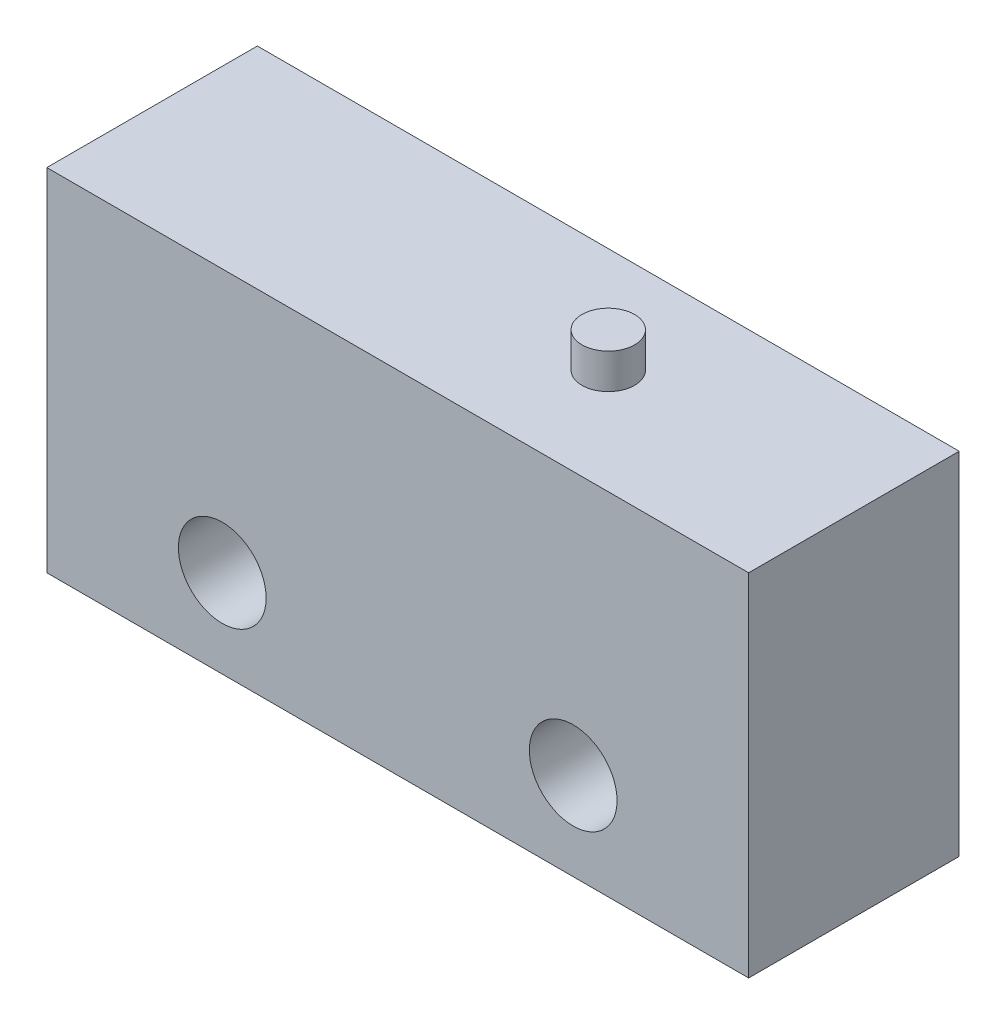
ISO-10303-21;
HEADER;
FILE_DESCRIPTION(('STEP AP214'),'2;1');
FILE_NAME('part.step','',(''),(''),'','','');
FILE_SCHEMA(('AUTOMOTIVE_DESIGN { 1 0 10303 214 1 1 1 1 }'));
ENDSEC;
DATA;
#1=APPLICATION_CONTEXT('core data for automotive mechanical design processes');
#2=APPLICATION_PROTOCOL_DEFINITION('international standard','automotive_design',2000,#1);
#3=PRODUCT_CONTEXT('',#1,'mechanical');
#4=PRODUCT('Part','Part','',(#3));
#5=PRODUCT_RELATED_PRODUCT_CATEGORY('part','',(#4));
#6=PRODUCT_DEFINITION_FORMATION('','',#4);
#7=PRODUCT_DEFINITION_CONTEXT('part definition',#1,'design');
#8=PRODUCT_DEFINITION('design','',#6,#7);
#9=PRODUCT_DEFINITION_SHAPE('','',#8);
#10=(LENGTH_UNIT() NAMED_UNIT(*) SI_UNIT(.MILLI.,.METRE.));
#11=(NAMED_UNIT(*) PLANE_ANGLE_UNIT() SI_UNIT($,.RADIAN.));
#12=(NAMED_UNIT(*) SI_UNIT($,.STERADIAN.) SOLID_ANGLE_UNIT());
#13=UNCERTAINTY_MEASURE_WITH_UNIT(LENGTH_MEASURE(1.E-05),#10,'distance_accuracy_value','');
#14=(GEOMETRIC_REPRESENTATION_CONTEXT(3) GLOBAL_UNCERTAINTY_ASSIGNED_CONTEXT((#13)) GLOBAL_UNIT_ASSIGNED_CONTEXT((#10,
#11,#12)) REPRESENTATION_CONTEXT('',''));
#15=CARTESIAN_POINT('',(0.,0.,0.));
#16=DIRECTION('',(0.,0.,1.));
#17=DIRECTION('',(1.,0.,0.));
#18=AXIS2_PLACEMENT_3D('',#15,#16,#17);
#19=CARTESIAN_POINT('',(10.,4.99999999999999,6.));
#20=DIRECTION('',(0.,-1.,0.));
#21=DIRECTION('',(0.,0.,-1.));
#22=AXIS2_PLACEMENT_3D('',#19,#20,#21);
#23=PLANE('',#22);
#24=DIRECTION('',(-1.,0.,0.));
#25=VECTOR('',#24,1.);
#26=CARTESIAN_POINT('',(10.,4.99999999999999,0.));
#27=LINE('',#26,#25);
#28=CARTESIAN_POINT('',(10.,4.99999999999999,0.));
#29=VERTEX_POINT('',#28);
#30=CARTESIAN_POINT('',(-9.99999999999998,4.99999999999999,0.));
#31=VERTEX_POINT('',#30);
#32=EDGE_CURVE('E122',#29,#31,#27,.T.);
#33=ORIENTED_EDGE('',*,*,#32,.T.);
#34=DIRECTION('',(0.,0.,-1.));
#35=VECTOR('',#34,1.);
#36=CARTESIAN_POINT('',(-9.99999999999998,4.99999999999999,6.));
#37=LINE('',#36,#35);
#38=CARTESIAN_POINT('',(-9.99999999999998,4.99999999999999,6.));
#39=VERTEX_POINT('',#38);
#40=EDGE_CURVE('E119',#39,#31,#37,.T.);
#41=ORIENTED_EDGE('',*,*,#40,.F.);
#42=DIRECTION('',(-1.,0.,0.));
#43=VECTOR('',#42,1.);
#44=CARTESIAN_POINT('',(10.,4.99999999999999,6.));
#45=LINE('',#44,#43);
#46=CARTESIAN_POINT('',(10.,4.99999999999999,6.));
#47=VERTEX_POINT('',#46);
#48=EDGE_CURVE('E109',#47,#39,#45,.T.);
#49=ORIENTED_EDGE('',*,*,#48,.F.);
#50=DIRECTION('',(0.,0.,-1.));
#51=VECTOR('',#50,1.);
#52=CARTESIAN_POINT('',(10.,4.99999999999999,6.));
#53=LINE('',#52,#51);
#54=EDGE_CURVE('E124',#47,#29,#53,.T.);
#55=ORIENTED_EDGE('',*,*,#54,.T.);
#56=EDGE_LOOP('',(#33,#41,#49,#55));
#57=FACE_BOUND('',#56,.T.);
#58=CARTESIAN_POINT('',(3.00000000000002,4.99999999999999,3.));
#59=DIRECTION('',(0.,-1.,0.));
#60=DIRECTION('',(0.,0.,-1.));
#61=AXIS2_PLACEMENT_3D('',#58,#59,#60);
#62=CIRCLE('',#61,0.75);
#63=CARTESIAN_POINT('',(3.00000000000002,4.99999999999999,2.25));
#64=VERTEX_POINT('',#63);
#65=EDGE_CURVE('E12',#64,#64,#62,.F.);
#66=ORIENTED_EDGE('',*,*,#65,.F.);
#67=EDGE_LOOP('',(#66));
#68=FACE_BOUND('',#67,.T.);
#69=ADVANCED_FACE('F63',(#57,#68),#23,.F.);
#70=CARTESIAN_POINT('',(0.,0.,6.));
#71=DIRECTION('',(0.,0.,-1.));
#72=DIRECTION('',(-1.,0.,0.));
#73=AXIS2_PLACEMENT_3D('',#70,#71,#72);
#74=PLANE('',#73);
#75=CARTESIAN_POINT('',(-4.99999999999998,-2.50000000000001,6.));
#76=DIRECTION('',(0.,0.,1.));
#77=DIRECTION('',(1.,0.,0.));
#78=AXIS2_PLACEMENT_3D('',#75,#76,#77);
#79=CIRCLE('',#78,1.25);
#80=CARTESIAN_POINT('',(-3.74999999999998,-2.50000000000001,6.));
#81=VERTEX_POINT('',#80);
#82=EDGE_CURVE('E137',#81,#81,#79,.T.);
#83=ORIENTED_EDGE('',*,*,#82,.F.);
#84=EDGE_LOOP('',(#83));
#85=FACE_BOUND('',#84,.T.);
#86=DIRECTION('',(-1.,0.,0.));
#87=VECTOR('',#86,1.);
#88=CARTESIAN_POINT('',(10.,-5.00000000000002,6.));
#89=LINE('',#88,#87);
#90=CARTESIAN_POINT('',(10.,-5.00000000000002,6.));
#91=VERTEX_POINT('',#90);
#92=CARTESIAN_POINT('',(-9.99999999999998,-5.00000000000001,6.));
#93=VERTEX_POINT('',#92);
#94=EDGE_CURVE('E127',#91,#93,#89,.T.);
#95=ORIENTED_EDGE('',*,*,#94,.F.);
#96=DIRECTION('',(0.,1.,0.));
#97=VECTOR('',#96,1.);
#98=CARTESIAN_POINT('',(10.,-5.00000000000002,6.));
#99=LINE('',#98,#97);
#100=EDGE_CURVE('E115',#91,#47,#99,.T.);
#101=ORIENTED_EDGE('',*,*,#100,.T.);
#102=ORIENTED_EDGE('',*,*,#48,.T.);
#103=DIRECTION('',(0.,1.,0.));
#104=VECTOR('',#103,1.);
#105=CARTESIAN_POINT('',(-9.99999999999998,-5.00000000000001,6.));
#106=LINE('',#105,#104);
#107=EDGE_CURVE('E114',#93,#39,#106,.T.);
#108=ORIENTED_EDGE('',*,*,#107,.F.);
#109=EDGE_LOOP('',(#95,#101,#102,#108));
#110=FACE_BOUND('',#109,.T.);
#111=CARTESIAN_POINT('',(5.00000000000002,-2.50000000000001,6.));
#112=DIRECTION('',(0.,0.,1.));
#113=DIRECTION('',(1.,0.,0.));
#114=AXIS2_PLACEMENT_3D('',#111,#112,#113);
#115=CIRCLE('',#114,1.25);
#116=CARTESIAN_POINT('',(6.25000000000002,-2.50000000000001,6.));
#117=VERTEX_POINT('',#116);
#118=EDGE_CURVE('E152',#117,#117,#115,.T.);
#119=ORIENTED_EDGE('',*,*,#118,.F.);
#120=EDGE_LOOP('',(#119));
#121=FACE_BOUND('',#120,.T.);
#122=ADVANCED_FACE('F112',(#85,#110,#121),#74,.F.);
#123=CARTESIAN_POINT('',(0.,0.,0.));
#124=DIRECTION('',(0.,0.,-1.));
#125=DIRECTION('',(-1.,0.,0.));
#126=AXIS2_PLACEMENT_3D('',#123,#124,#125);
#127=PLANE('',#126);
#128=CARTESIAN_POINT('',(-4.99999999999998,-2.50000000000001,0.));
#129=DIRECTION('',(0.,0.,1.));
#130=DIRECTION('',(1.,0.,0.));
#131=AXIS2_PLACEMENT_3D('',#128,#129,#130);
#132=CIRCLE('',#131,1.25);
#133=CARTESIAN_POINT('',(-3.74999999999998,-2.50000000000001,0.));
#134=VERTEX_POINT('',#133);
#135=EDGE_CURVE('E156',#134,#134,#132,.T.);
#136=ORIENTED_EDGE('',*,*,#135,.T.);
#137=EDGE_LOOP('',(#136));
#138=FACE_BOUND('',#137,.T.);
#139=DIRECTION('',(-1.,0.,0.));
#140=VECTOR('',#139,1.);
#141=CARTESIAN_POINT('',(10.,-5.00000000000002,0.));
#142=LINE('',#141,#140);
#143=CARTESIAN_POINT('',(10.,-5.00000000000002,0.));
#144=VERTEX_POINT('',#143);
#145=CARTESIAN_POINT('',(-9.99999999999998,-5.00000000000001,0.));
#146=VERTEX_POINT('',#145);
#147=EDGE_CURVE('E133',#144,#146,#142,.T.);
#148=ORIENTED_EDGE('',*,*,#147,.T.);
#149=DIRECTION('',(0.,1.,0.));
#150=VECTOR('',#149,1.);
#151=CARTESIAN_POINT('',(-9.99999999999998,-5.00000000000001,0.));
#152=LINE('',#151,#150);
#153=EDGE_CURVE('E136',#146,#31,#152,.T.);
#154=ORIENTED_EDGE('',*,*,#153,.T.);
#155=ORIENTED_EDGE('',*,*,#32,.F.);
#156=DIRECTION('',(0.,1.,0.));
#157=VECTOR('',#156,1.);
#158=CARTESIAN_POINT('',(10.,-5.00000000000002,0.));
#159=LINE('',#158,#157);
#160=EDGE_CURVE('E96',#144,#29,#159,.T.);
#161=ORIENTED_EDGE('',*,*,#160,.F.);
#162=EDGE_LOOP('',(#148,#154,#155,#161));
#163=FACE_BOUND('',#162,.T.);
#164=CARTESIAN_POINT('',(5.00000000000002,-2.50000000000001,0.));
#165=DIRECTION('',(0.,0.,1.));
#166=DIRECTION('',(1.,0.,0.));
#167=AXIS2_PLACEMENT_3D('',#164,#165,#166);
#168=CIRCLE('',#167,1.25);
#169=CARTESIAN_POINT('',(6.25000000000002,-2.50000000000001,0.));
#170=VERTEX_POINT('',#169);
#171=EDGE_CURVE('E150',#170,#170,#168,.T.);
#172=ORIENTED_EDGE('',*,*,#171,.T.);
#173=EDGE_LOOP('',(#172));
#174=FACE_BOUND('',#173,.T.);
#175=ADVANCED_FACE('F143',(#138,#163,#174),#127,.T.);
#176=CARTESIAN_POINT('',(10.,-5.00000000000002,6.));
#177=DIRECTION('',(0.,-1.,0.));
#178=DIRECTION('',(1.,0.,0.));
#179=AXIS2_PLACEMENT_3D('',#176,#177,#178);
#180=PLANE('',#179);
#181=ORIENTED_EDGE('',*,*,#147,.F.);
#182=DIRECTION('',(0.,0.,-1.));
#183=VECTOR('',#182,1.);
#184=CARTESIAN_POINT('',(10.,-5.00000000000002,6.));
#185=LINE('',#184,#183);
#186=EDGE_CURVE('E72',#91,#144,#185,.T.);
#187=ORIENTED_EDGE('',*,*,#186,.F.);
#188=ORIENTED_EDGE('',*,*,#94,.T.);
#189=DIRECTION('',(0.,0.,-1.));
#190=VECTOR('',#189,1.);
#191=CARTESIAN_POINT('',(-9.99999999999998,-5.00000000000001,6.));
#192=LINE('',#191,#190);
#193=EDGE_CURVE('E104',#93,#146,#192,.T.);
#194=ORIENTED_EDGE('',*,*,#193,.T.);
#195=EDGE_LOOP('',(#181,#187,#188,#194));
#196=FACE_BOUND('',#195,.T.);
#197=ADVANCED_FACE('F65',(#196),#180,.T.);
#198=CARTESIAN_POINT('',(10.,-5.00000000000002,6.));
#199=DIRECTION('',(-1.,0.,0.));
#200=DIRECTION('',(0.,0.,1.));
#201=AXIS2_PLACEMENT_3D('',#198,#199,#200);
#202=PLANE('',#201);
#203=ORIENTED_EDGE('',*,*,#160,.T.);
#204=ORIENTED_EDGE('',*,*,#54,.F.);
#205=ORIENTED_EDGE('',*,*,#100,.F.);
#206=ORIENTED_EDGE('',*,*,#186,.T.);
#207=EDGE_LOOP('',(#203,#204,#205,#206));
#208=FACE_BOUND('',#207,.T.);
#209=ADVANCED_FACE('F177',(#208),#202,.F.);
#210=CARTESIAN_POINT('',(-9.99999999999998,-5.00000000000001,6.));
#211=DIRECTION('',(-1.,0.,0.));
#212=DIRECTION('',(0.,0.,1.));
#213=AXIS2_PLACEMENT_3D('',#210,#211,#212);
#214=PLANE('',#213);
#215=ORIENTED_EDGE('',*,*,#153,.F.);
#216=ORIENTED_EDGE('',*,*,#193,.F.);
#217=ORIENTED_EDGE('',*,*,#107,.T.);
#218=ORIENTED_EDGE('',*,*,#40,.T.);
#219=EDGE_LOOP('',(#215,#216,#217,#218));
#220=FACE_BOUND('',#219,.T.);
#221=ADVANCED_FACE('F126',(#220),#214,.T.);
#222=CARTESIAN_POINT('',(-4.99999999999998,-2.50000000000001,6.));
#223=DIRECTION('',(0.,0.,-1.));
#224=DIRECTION('',(-1.,0.,0.));
#225=AXIS2_PLACEMENT_3D('',#222,#223,#224);
#226=CYLINDRICAL_SURFACE('',#225,1.25);
#227=ORIENTED_EDGE('',*,*,#82,.T.);
#228=EDGE_LOOP('',(#227));
#229=FACE_BOUND('',#228,.T.);
#230=ORIENTED_EDGE('',*,*,#135,.F.);
#231=EDGE_LOOP('',(#230));
#232=FACE_BOUND('',#231,.T.);
#233=ADVANCED_FACE('F165',(#229,#232),#226,.F.);
#234=CARTESIAN_POINT('',(5.00000000000002,-2.50000000000001,6.));
#235=DIRECTION('',(0.,0.,-1.));
#236=DIRECTION('',(-1.,0.,0.));
#237=AXIS2_PLACEMENT_3D('',#234,#235,#236);
#238=CYLINDRICAL_SURFACE('',#237,1.25);
#239=ORIENTED_EDGE('',*,*,#118,.T.);
#240=EDGE_LOOP('',(#239));
#241=FACE_BOUND('',#240,.T.);
#242=ORIENTED_EDGE('',*,*,#171,.F.);
#243=EDGE_LOOP('',(#242));
#244=FACE_BOUND('',#243,.T.);
#245=ADVANCED_FACE('F167',(#241,#244),#238,.F.);
#246=CARTESIAN_POINT('',(3.00000000000002,5.99999999999999,3.));
#247=DIRECTION('',(0.,-1.,0.));
#248=DIRECTION('',(0.,0.,-1.));
#249=AXIS2_PLACEMENT_3D('',#246,#247,#248);
#250=CYLINDRICAL_SURFACE('',#249,0.75);
#251=CARTESIAN_POINT('',(3.00000000000002,5.99999999999999,3.));
#252=DIRECTION('',(0.,1.,0.));
#253=DIRECTION('',(0.,0.,1.));
#254=AXIS2_PLACEMENT_3D('',#251,#252,#253);
#255=CIRCLE('',#254,0.75);
#256=CARTESIAN_POINT('',(3.00000000000002,5.99999999999999,3.75));
#257=VERTEX_POINT('',#256);
#258=EDGE_CURVE('E153',#257,#257,#255,.T.);
#259=ORIENTED_EDGE('',*,*,#258,.F.);
#260=EDGE_LOOP('',(#259));
#261=FACE_BOUND('',#260,.T.);
#262=ORIENTED_EDGE('',*,*,#65,.T.);
#263=EDGE_LOOP('',(#262));
#264=FACE_BOUND('',#263,.T.);
#265=ADVANCED_FACE('F174',(#261,#264),#250,.T.);
#266=CARTESIAN_POINT('',(3.00000000000002,5.99999999999999,3.));
#267=DIRECTION('',(0.,1.,0.));
#268=DIRECTION('',(0.,0.,1.));
#269=AXIS2_PLACEMENT_3D('',#266,#267,#268);
#270=PLANE('',#269);
#271=ORIENTED_EDGE('',*,*,#258,.T.);
#272=EDGE_LOOP('',(#271));
#273=FACE_BOUND('',#272,.T.);
#274=ADVANCED_FACE('F242',(#273),#270,.T.);
#275=CLOSED_SHELL('',(#69,#122,#175,#197,#209,#221,#233,#245,#265,#274));
#276=MANIFOLD_SOLID_BREP('B2',#275);
#277=ADVANCED_BREP_SHAPE_REPRESENTATION('',(#18,#276),#14);
#278=SHAPE_DEFINITION_REPRESENTATION(#9,#277);
ENDSEC;
END-ISO-10303-21;
